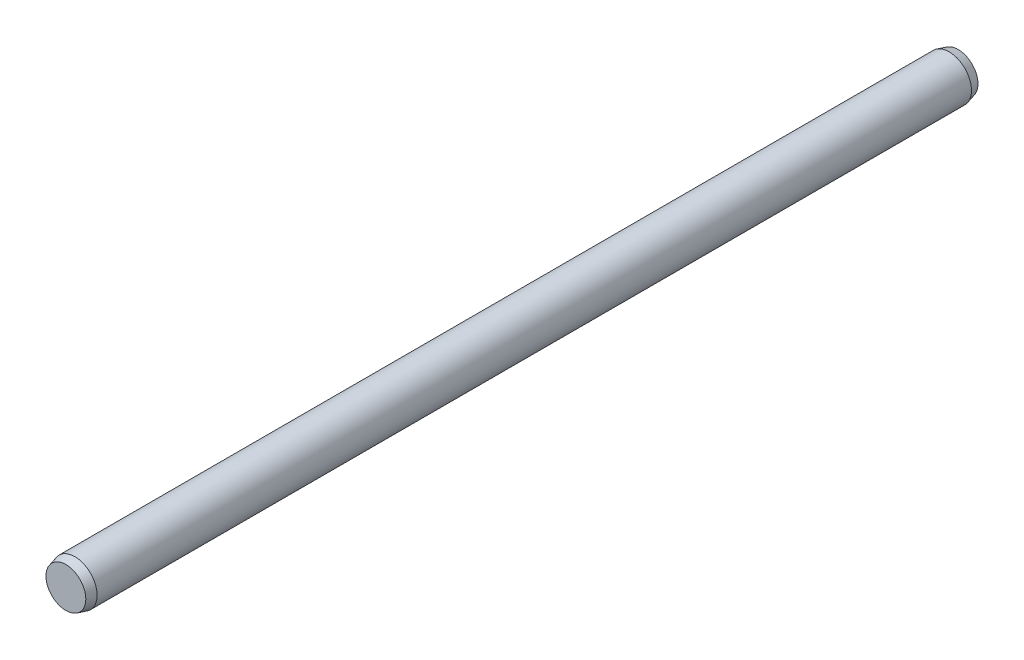
ISO-10303-21;
HEADER;
FILE_DESCRIPTION(('STEP AP214'),'2;1');
FILE_NAME('part.step','',(''),(''),'','','');
FILE_SCHEMA(('AUTOMOTIVE_DESIGN { 1 0 10303 214 1 1 1 1 }'));
ENDSEC;
DATA;
#1=APPLICATION_CONTEXT('core data for automotive mechanical design processes');
#2=APPLICATION_PROTOCOL_DEFINITION('international standard','automotive_design',2000,#1);
#3=PRODUCT_CONTEXT('',#1,'mechanical');
#4=PRODUCT('Part','Part','',(#3));
#5=PRODUCT_RELATED_PRODUCT_CATEGORY('part','',(#4));
#6=PRODUCT_DEFINITION_FORMATION('','',#4);
#7=PRODUCT_DEFINITION_CONTEXT('part definition',#1,'design');
#8=PRODUCT_DEFINITION('design','',#6,#7);
#9=PRODUCT_DEFINITION_SHAPE('','',#8);
#10=(LENGTH_UNIT() NAMED_UNIT(*) SI_UNIT(.MILLI.,.METRE.));
#11=(NAMED_UNIT(*) PLANE_ANGLE_UNIT() SI_UNIT($,.RADIAN.));
#12=(NAMED_UNIT(*) SI_UNIT($,.STERADIAN.) SOLID_ANGLE_UNIT());
#13=UNCERTAINTY_MEASURE_WITH_UNIT(LENGTH_MEASURE(1.E-05),#10,'distance_accuracy_value','');
#14=(GEOMETRIC_REPRESENTATION_CONTEXT(3) GLOBAL_UNCERTAINTY_ASSIGNED_CONTEXT((#13)) GLOBAL_UNIT_ASSIGNED_CONTEXT((#10,
#11,#12)) REPRESENTATION_CONTEXT('',''));
#15=CARTESIAN_POINT('',(0.,0.,0.));
#16=DIRECTION('',(0.,0.,1.));
#17=DIRECTION('',(1.,0.,0.));
#18=AXIS2_PLACEMENT_3D('',#15,#16,#17);
#19=CARTESIAN_POINT('',(0.,0.,9.8));
#20=DIRECTION('',(0.,0.,-1.));
#21=DIRECTION('',(-1.,0.,0.));
#22=AXIS2_PLACEMENT_3D('',#19,#20,#21);
#23=CONICAL_SURFACE('',#22,0.5,0.261799387799148);
#24=CARTESIAN_POINT('',(0.,0.,10.));
#25=DIRECTION('',(0.,0.,1.));
#26=DIRECTION('',(1.,0.,0.));
#27=AXIS2_PLACEMENT_3D('',#24,#25,#26);
#28=CIRCLE('',#27,0.446410161513775);
#29=CARTESIAN_POINT('',(0.446410161513775,0.,10.));
#30=VERTEX_POINT('',#29);
#31=EDGE_CURVE('E51',#30,#30,#28,.T.);
#32=ORIENTED_EDGE('',*,*,#31,.F.);
#33=EDGE_LOOP('',(#32));
#34=FACE_BOUND('',#33,.T.);
#35=CARTESIAN_POINT('',(0.,0.,9.8));
#36=DIRECTION('',(0.,0.,1.));
#37=DIRECTION('',(1.,0.,0.));
#38=AXIS2_PLACEMENT_3D('',#35,#36,#37);
#39=CIRCLE('',#38,0.5);
#40=CARTESIAN_POINT('',(0.5,0.,9.8));
#41=VERTEX_POINT('',#40);
#42=EDGE_CURVE('E10',#41,#41,#39,.T.);
#43=ORIENTED_EDGE('',*,*,#42,.T.);
#44=EDGE_LOOP('',(#43));
#45=FACE_BOUND('',#44,.T.);
#46=ADVANCED_FACE('F37',(#34,#45),#23,.T.);
#47=CARTESIAN_POINT('',(0.,0.,10.));
#48=DIRECTION('',(0.,0.,1.));
#49=DIRECTION('',(1.,0.,0.));
#50=AXIS2_PLACEMENT_3D('',#47,#48,#49);
#51=CYLINDRICAL_SURFACE('',#50,0.5);
#52=ORIENTED_EDGE('',*,*,#42,.F.);
#53=EDGE_LOOP('',(#52));
#54=FACE_BOUND('',#53,.T.);
#55=CARTESIAN_POINT('',(0.,0.,-9.8));
#56=DIRECTION('',(0.,0.,1.));
#57=DIRECTION('',(1.,0.,0.));
#58=AXIS2_PLACEMENT_3D('',#55,#56,#57);
#59=CIRCLE('',#58,0.5);
#60=CARTESIAN_POINT('',(0.5,0.,-9.8));
#61=VERTEX_POINT('',#60);
#62=EDGE_CURVE('E43',#61,#61,#59,.T.);
#63=ORIENTED_EDGE('',*,*,#62,.T.);
#64=EDGE_LOOP('',(#63));
#65=FACE_BOUND('',#64,.T.);
#66=ADVANCED_FACE('F60',(#54,#65),#51,.T.);
#67=CARTESIAN_POINT('',(0.,0.,-10.));
#68=DIRECTION('',(0.,0.,1.));
#69=DIRECTION('',(1.,0.,0.));
#70=AXIS2_PLACEMENT_3D('',#67,#68,#69);
#71=CONICAL_SURFACE('',#70,0.446410161513775,0.261799387799144);
#72=ORIENTED_EDGE('',*,*,#62,.F.);
#73=EDGE_LOOP('',(#72));
#74=FACE_BOUND('',#73,.T.);
#75=CARTESIAN_POINT('',(0.,0.,-10.));
#76=DIRECTION('',(0.,0.,1.));
#77=DIRECTION('',(1.,0.,0.));
#78=AXIS2_PLACEMENT_3D('',#75,#76,#77);
#79=CIRCLE('',#78,0.446410161513775);
#80=CARTESIAN_POINT('',(0.446410161513775,0.,-10.));
#81=VERTEX_POINT('',#80);
#82=EDGE_CURVE('E47',#81,#81,#79,.T.);
#83=ORIENTED_EDGE('',*,*,#82,.T.);
#84=EDGE_LOOP('',(#83));
#85=FACE_BOUND('',#84,.T.);
#86=ADVANCED_FACE('F64',(#74,#85),#71,.T.);
#87=CARTESIAN_POINT('',(0.,0.446410161513775,-10.));
#88=DIRECTION('',(0.,0.,1.));
#89=DIRECTION('',(1.,0.,0.));
#90=AXIS2_PLACEMENT_3D('',#87,#88,#89);
#91=PLANE('',#90);
#92=ORIENTED_EDGE('',*,*,#82,.F.);
#93=EDGE_LOOP('',(#92));
#94=FACE_BOUND('',#93,.T.);
#95=ADVANCED_FACE('F69',(#94),#91,.F.);
#96=CARTESIAN_POINT('',(0.,0.,10.));
#97=DIRECTION('',(0.,0.,-1.));
#98=DIRECTION('',(-1.,0.,0.));
#99=AXIS2_PLACEMENT_3D('',#96,#97,#98);
#100=PLANE('',#99);
#101=ORIENTED_EDGE('',*,*,#31,.T.);
#102=EDGE_LOOP('',(#101));
#103=FACE_BOUND('',#102,.T.);
#104=ADVANCED_FACE('F57',(#103),#100,.F.);
#105=CLOSED_SHELL('',(#46,#66,#86,#95,#104));
#106=MANIFOLD_SOLID_BREP('B2',#105);
#107=ADVANCED_BREP_SHAPE_REPRESENTATION('',(#18,#106),#14);
#108=SHAPE_DEFINITION_REPRESENTATION(#9,#107);
ENDSEC;
END-ISO-10303-21;
